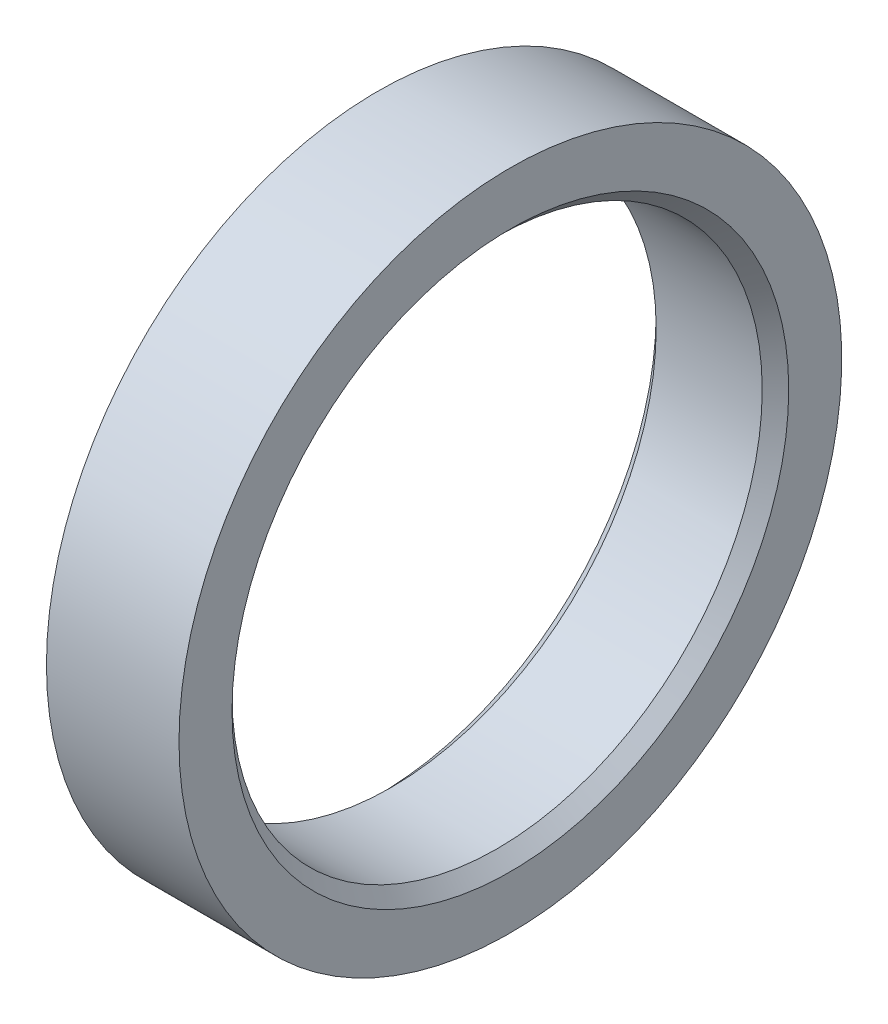
ISO-10303-21;
HEADER;
FILE_DESCRIPTION(('STEP AP214'),'2;1');
FILE_NAME('part.step','',(''),(''),'','','');
FILE_SCHEMA(('AUTOMOTIVE_DESIGN { 1 0 10303 214 1 1 1 1 }'));
ENDSEC;
DATA;
#1=APPLICATION_CONTEXT('core data for automotive mechanical design processes');
#2=APPLICATION_PROTOCOL_DEFINITION('international standard','automotive_design',2000,#1);
#3=PRODUCT_CONTEXT('',#1,'mechanical');
#4=PRODUCT('Part','Part','',(#3));
#5=PRODUCT_RELATED_PRODUCT_CATEGORY('part','',(#4));
#6=PRODUCT_DEFINITION_FORMATION('','',#4);
#7=PRODUCT_DEFINITION_CONTEXT('part definition',#1,'design');
#8=PRODUCT_DEFINITION('design','',#6,#7);
#9=PRODUCT_DEFINITION_SHAPE('','',#8);
#10=(LENGTH_UNIT() NAMED_UNIT(*) SI_UNIT(.MILLI.,.METRE.));
#11=(NAMED_UNIT(*) PLANE_ANGLE_UNIT() SI_UNIT($,.RADIAN.));
#12=(NAMED_UNIT(*) SI_UNIT($,.STERADIAN.) SOLID_ANGLE_UNIT());
#13=UNCERTAINTY_MEASURE_WITH_UNIT(LENGTH_MEASURE(1.E-05),#10,'distance_accuracy_value','');
#14=(GEOMETRIC_REPRESENTATION_CONTEXT(3) GLOBAL_UNCERTAINTY_ASSIGNED_CONTEXT((#13)) GLOBAL_UNIT_ASSIGNED_CONTEXT((#10,
#11,#12)) REPRESENTATION_CONTEXT('',''));
#15=CARTESIAN_POINT('',(0.,0.,0.));
#16=DIRECTION('',(0.,0.,1.));
#17=DIRECTION('',(1.,0.,0.));
#18=AXIS2_PLACEMENT_3D('',#15,#16,#17);
#19=CARTESIAN_POINT('',(0.,0.,0.));
#20=DIRECTION('',(-1.,0.,0.));
#21=DIRECTION('',(0.,0.,1.));
#22=AXIS2_PLACEMENT_3D('',#19,#20,#21);
#23=CYLINDRICAL_SURFACE('',#22,25.);
#24=CARTESIAN_POINT('',(0.,0.,0.));
#25=DIRECTION('',(-1.,0.,0.));
#26=DIRECTION('',(0.,0.,1.));
#27=AXIS2_PLACEMENT_3D('',#24,#25,#26);
#28=CIRCLE('',#27,25.);
#29=CARTESIAN_POINT('',(0.,0.,25.));
#30=VERTEX_POINT('',#29);
#31=EDGE_CURVE('E56',#30,#30,#28,.T.);
#32=ORIENTED_EDGE('',*,*,#31,.F.);
#33=EDGE_LOOP('',(#32));
#34=FACE_BOUND('',#33,.T.);
#35=CARTESIAN_POINT('',(10.,0.,0.));
#36=DIRECTION('',(-1.,0.,0.));
#37=DIRECTION('',(0.,0.,1.));
#38=AXIS2_PLACEMENT_3D('',#35,#36,#37);
#39=CIRCLE('',#38,25.);
#40=CARTESIAN_POINT('',(10.,0.,25.));
#41=VERTEX_POINT('',#40);
#42=EDGE_CURVE('E53',#41,#41,#39,.T.);
#43=ORIENTED_EDGE('',*,*,#42,.T.);
#44=EDGE_LOOP('',(#43));
#45=FACE_BOUND('',#44,.T.);
#46=ADVANCED_FACE('F33',(#34,#45),#23,.T.);
#47=CARTESIAN_POINT('',(10.,25.,0.));
#48=DIRECTION('',(-1.,0.,0.));
#49=DIRECTION('',(0.,0.,1.));
#50=AXIS2_PLACEMENT_3D('',#47,#48,#49);
#51=PLANE('',#50);
#52=CARTESIAN_POINT('',(10.,0.,0.));
#53=DIRECTION('',(-1.,0.,0.));
#54=DIRECTION('',(0.,0.,1.));
#55=AXIS2_PLACEMENT_3D('',#52,#53,#54);
#56=CIRCLE('',#55,21.);
#57=CARTESIAN_POINT('',(10.,0.,21.));
#58=VERTEX_POINT('',#57);
#59=EDGE_CURVE('E10',#58,#58,#56,.T.);
#60=ORIENTED_EDGE('',*,*,#59,.T.);
#61=EDGE_LOOP('',(#60));
#62=FACE_BOUND('',#61,.T.);
#63=ORIENTED_EDGE('',*,*,#42,.F.);
#64=EDGE_LOOP('',(#63));
#65=FACE_BOUND('',#64,.T.);
#66=ADVANCED_FACE('F64',(#62,#65),#51,.F.);
#67=CARTESIAN_POINT('',(0.,0.,0.));
#68=DIRECTION('',(-1.,0.,0.));
#69=DIRECTION('',(0.,0.,1.));
#70=AXIS2_PLACEMENT_3D('',#67,#68,#69);
#71=CYLINDRICAL_SURFACE('',#70,20.);
#72=CARTESIAN_POINT('',(1.,0.,0.));
#73=DIRECTION('',(1.,0.,0.));
#74=DIRECTION('',(0.,0.,-1.));
#75=AXIS2_PLACEMENT_3D('',#72,#73,#74);
#76=CIRCLE('',#75,20.);
#77=CARTESIAN_POINT('',(1.,0.,-20.));
#78=VERTEX_POINT('',#77);
#79=EDGE_CURVE('E44',#78,#78,#76,.F.);
#80=ORIENTED_EDGE('',*,*,#79,.T.);
#81=EDGE_LOOP('',(#80));
#82=FACE_BOUND('',#81,.T.);
#83=CARTESIAN_POINT('',(9.00000000000001,0.,0.));
#84=DIRECTION('',(-1.,0.,0.));
#85=DIRECTION('',(0.,0.,1.));
#86=AXIS2_PLACEMENT_3D('',#83,#84,#85);
#87=CIRCLE('',#86,20.);
#88=CARTESIAN_POINT('',(9.00000000000001,0.,20.));
#89=VERTEX_POINT('',#88);
#90=EDGE_CURVE('E48',#89,#89,#87,.F.);
#91=ORIENTED_EDGE('',*,*,#90,.T.);
#92=EDGE_LOOP('',(#91));
#93=FACE_BOUND('',#92,.T.);
#94=ADVANCED_FACE('F69',(#82,#93),#71,.F.);
#95=CARTESIAN_POINT('',(0.,20.,0.));
#96=DIRECTION('',(1.,0.,0.));
#97=DIRECTION('',(0.,0.,-1.));
#98=AXIS2_PLACEMENT_3D('',#95,#96,#97);
#99=PLANE('',#98);
#100=CARTESIAN_POINT('',(0.,0.,0.));
#101=DIRECTION('',(1.,0.,0.));
#102=DIRECTION('',(0.,0.,-1.));
#103=AXIS2_PLACEMENT_3D('',#100,#101,#102);
#104=CIRCLE('',#103,21.);
#105=CARTESIAN_POINT('',(0.,0.,-21.));
#106=VERTEX_POINT('',#105);
#107=EDGE_CURVE('E40',#106,#106,#104,.T.);
#108=ORIENTED_EDGE('',*,*,#107,.T.);
#109=EDGE_LOOP('',(#108));
#110=FACE_BOUND('',#109,.T.);
#111=ORIENTED_EDGE('',*,*,#31,.T.);
#112=EDGE_LOOP('',(#111));
#113=FACE_BOUND('',#112,.T.);
#114=ADVANCED_FACE('F60',(#110,#113),#99,.F.);
#115=CARTESIAN_POINT('',(1.,0.,0.));
#116=DIRECTION('',(-1.,0.,0.));
#117=DIRECTION('',(0.,0.,1.));
#118=AXIS2_PLACEMENT_3D('',#115,#116,#117);
#119=CONICAL_SURFACE('',#118,20.,0.785398163397452);
#120=ORIENTED_EDGE('',*,*,#107,.F.);
#121=EDGE_LOOP('',(#120));
#122=FACE_BOUND('',#121,.T.);
#123=ORIENTED_EDGE('',*,*,#79,.F.);
#124=EDGE_LOOP('',(#123));
#125=FACE_BOUND('',#124,.T.);
#126=ADVANCED_FACE('F77',(#122,#125),#119,.F.);
#127=CARTESIAN_POINT('',(10.,0.,0.));
#128=DIRECTION('',(1.,0.,0.));
#129=DIRECTION('',(0.,0.,-1.));
#130=AXIS2_PLACEMENT_3D('',#127,#128,#129);
#131=CONICAL_SURFACE('',#130,21.,0.785398163397448);
#132=ORIENTED_EDGE('',*,*,#90,.F.);
#133=EDGE_LOOP('',(#132));
#134=FACE_BOUND('',#133,.T.);
#135=ORIENTED_EDGE('',*,*,#59,.F.);
#136=EDGE_LOOP('',(#135));
#137=FACE_BOUND('',#136,.T.);
#138=ADVANCED_FACE('F35',(#134,#137),#131,.F.);
#139=CLOSED_SHELL('',(#46,#66,#94,#114,#126,#138));
#140=MANIFOLD_SOLID_BREP('B2',#139);
#141=ADVANCED_BREP_SHAPE_REPRESENTATION('',(#18,#140),#14);
#142=SHAPE_DEFINITION_REPRESENTATION(#9,#141);
ENDSEC;
END-ISO-10303-21;
